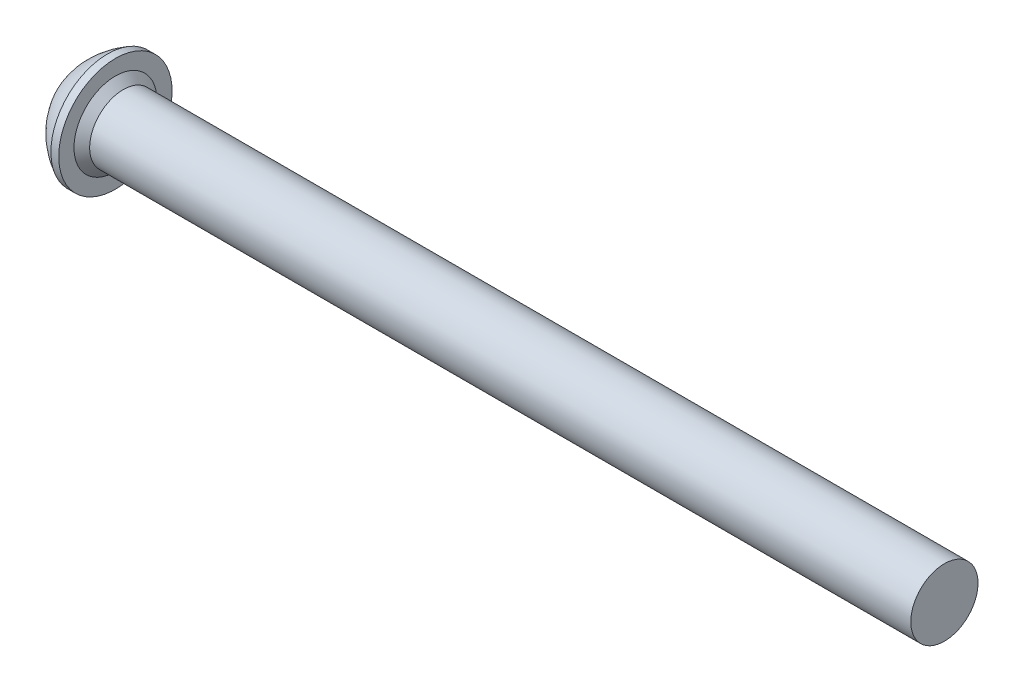
ISO-10303-21;
HEADER;
FILE_DESCRIPTION(('STEP AP214'),'2;1');
FILE_NAME('part.step','',(''),(''),'','','');
FILE_SCHEMA(('AUTOMOTIVE_DESIGN { 1 0 10303 214 1 1 1 1 }'));
ENDSEC;
DATA;
#1=APPLICATION_CONTEXT('core data for automotive mechanical design processes');
#2=APPLICATION_PROTOCOL_DEFINITION('international standard','automotive_design',2000,#1);
#3=PRODUCT_CONTEXT('',#1,'mechanical');
#4=PRODUCT('Part','Part','',(#3));
#5=PRODUCT_RELATED_PRODUCT_CATEGORY('part','',(#4));
#6=PRODUCT_DEFINITION_FORMATION('','',#4);
#7=PRODUCT_DEFINITION_CONTEXT('part definition',#1,'design');
#8=PRODUCT_DEFINITION('design','',#6,#7);
#9=PRODUCT_DEFINITION_SHAPE('','',#8);
#10=(LENGTH_UNIT() NAMED_UNIT(*) SI_UNIT(.MILLI.,.METRE.));
#11=(NAMED_UNIT(*) PLANE_ANGLE_UNIT() SI_UNIT($,.RADIAN.));
#12=(NAMED_UNIT(*) SI_UNIT($,.STERADIAN.) SOLID_ANGLE_UNIT());
#13=UNCERTAINTY_MEASURE_WITH_UNIT(LENGTH_MEASURE(1.E-05),#10,'distance_accuracy_value','');
#14=(GEOMETRIC_REPRESENTATION_CONTEXT(3) GLOBAL_UNCERTAINTY_ASSIGNED_CONTEXT((#13)) GLOBAL_UNIT_ASSIGNED_CONTEXT((#10,
#11,#12)) REPRESENTATION_CONTEXT('',''));
#15=CARTESIAN_POINT('',(0.,0.,0.));
#16=DIRECTION('',(0.,0.,1.));
#17=DIRECTION('',(1.,0.,0.));
#18=AXIS2_PLACEMENT_3D('',#15,#16,#17);
#19=CARTESIAN_POINT('',(38.6,1.5,0.));
#20=DIRECTION('',(1.,0.,0.));
#21=DIRECTION('',(0.,1.,0.));
#22=AXIS2_PLACEMENT_3D('',#19,#20,#21);
#23=PLANE('',#22);
#24=CARTESIAN_POINT('',(38.6,0.,0.));
#25=DIRECTION('',(1.,0.,0.));
#26=DIRECTION('',(0.,1.,0.));
#27=AXIS2_PLACEMENT_3D('',#24,#25,#26);
#28=CIRCLE('',#27,1.5);
#29=CARTESIAN_POINT('',(38.6,1.5,0.));
#30=VERTEX_POINT('',#29);
#31=EDGE_CURVE('E11',#30,#30,#28,.T.);
#32=ORIENTED_EDGE('',*,*,#31,.T.);
#33=EDGE_LOOP('',(#32));
#34=FACE_BOUND('',#33,.T.);
#35=ADVANCED_FACE('F33',(#34),#23,.T.);
#36=CARTESIAN_POINT('',(38.6,0.,0.));
#37=DIRECTION('',(1.,0.,0.));
#38=DIRECTION('',(0.,1.,0.));
#39=AXIS2_PLACEMENT_3D('',#36,#37,#38);
#40=CYLINDRICAL_SURFACE('',#39,1.5);
#41=CARTESIAN_POINT('',(1.95,0.,0.));
#42=DIRECTION('',(1.,0.,0.));
#43=DIRECTION('',(0.,1.,0.));
#44=AXIS2_PLACEMENT_3D('',#41,#42,#43);
#45=CIRCLE('',#44,1.5);
#46=CARTESIAN_POINT('',(1.95,1.5,0.));
#47=VERTEX_POINT('',#46);
#48=EDGE_CURVE('E40',#47,#47,#45,.T.);
#49=ORIENTED_EDGE('',*,*,#48,.T.);
#50=EDGE_LOOP('',(#49));
#51=FACE_BOUND('',#50,.T.);
#52=ORIENTED_EDGE('',*,*,#31,.F.);
#53=EDGE_LOOP('',(#52));
#54=FACE_BOUND('',#53,.T.);
#55=ADVANCED_FACE('F153',(#51,#54),#40,.T.);
#56=CARTESIAN_POINT('',(1.95,0.,0.));
#57=DIRECTION('',(-1.,0.,0.));
#58=DIRECTION('',(0.,-1.,0.));
#59=AXIS2_PLACEMENT_3D('',#56,#57,#58);
#60=CONICAL_SURFACE('',#59,1.5,0.785398163397446);
#61=CARTESIAN_POINT('',(1.6,0.,0.));
#62=DIRECTION('',(1.,0.,0.));
#63=DIRECTION('',(0.,1.,0.));
#64=AXIS2_PLACEMENT_3D('',#61,#62,#63);
#65=CIRCLE('',#64,1.85);
#66=CARTESIAN_POINT('',(1.6,1.85,0.));
#67=VERTEX_POINT('',#66);
#68=EDGE_CURVE('E148',#67,#67,#65,.T.);
#69=ORIENTED_EDGE('',*,*,#68,.T.);
#70=EDGE_LOOP('',(#69));
#71=FACE_BOUND('',#70,.T.);
#72=ORIENTED_EDGE('',*,*,#48,.F.);
#73=EDGE_LOOP('',(#72));
#74=FACE_BOUND('',#73,.T.);
#75=ADVANCED_FACE('F156',(#71,#74),#60,.T.);
#76=CARTESIAN_POINT('',(1.6,2.53,0.));
#77=DIRECTION('',(1.,0.,0.));
#78=DIRECTION('',(0.,1.,0.));
#79=AXIS2_PLACEMENT_3D('',#76,#77,#78);
#80=PLANE('',#79);
#81=CARTESIAN_POINT('',(1.6,0.,0.));
#82=DIRECTION('',(1.,0.,0.));
#83=DIRECTION('',(0.,1.,0.));
#84=AXIS2_PLACEMENT_3D('',#81,#82,#83);
#85=CIRCLE('',#84,2.53);
#86=CARTESIAN_POINT('',(1.6,2.53,0.));
#87=VERTEX_POINT('',#86);
#88=EDGE_CURVE('E145',#87,#87,#85,.T.);
#89=ORIENTED_EDGE('',*,*,#88,.T.);
#90=EDGE_LOOP('',(#89));
#91=FACE_BOUND('',#90,.T.);
#92=ORIENTED_EDGE('',*,*,#68,.F.);
#93=EDGE_LOOP('',(#92));
#94=FACE_BOUND('',#93,.T.);
#95=ADVANCED_FACE('F158',(#91,#94),#80,.T.);
#96=CARTESIAN_POINT('',(38.6,0.,0.));
#97=DIRECTION('',(1.,0.,0.));
#98=DIRECTION('',(0.,1.,0.));
#99=AXIS2_PLACEMENT_3D('',#96,#97,#98);
#100=CYLINDRICAL_SURFACE('',#99,2.53);
#101=CARTESIAN_POINT('',(1.25,0.,0.));
#102=DIRECTION('',(1.,0.,0.));
#103=DIRECTION('',(0.,1.,0.));
#104=AXIS2_PLACEMENT_3D('',#101,#102,#103);
#105=CIRCLE('',#104,2.53);
#106=CARTESIAN_POINT('',(1.25,2.53,0.));
#107=VERTEX_POINT('',#106);
#108=EDGE_CURVE('E142',#107,#107,#105,.T.);
#109=ORIENTED_EDGE('',*,*,#108,.T.);
#110=EDGE_LOOP('',(#109));
#111=FACE_BOUND('',#110,.T.);
#112=ORIENTED_EDGE('',*,*,#88,.F.);
#113=EDGE_LOOP('',(#112));
#114=FACE_BOUND('',#113,.T.);
#115=ADVANCED_FACE('F165',(#111,#114),#100,.T.);
#116=CARTESIAN_POINT('',(2.87083122473417,0.,0.));
#117=DIRECTION('',(1.,0.,0.));
#118=DIRECTION('',(0.,1.,0.));
#119=AXIS2_PLACEMENT_3D('',#116,#117,#118);
#120=DEGENERATE_TOROIDAL_SURFACE('',#119,0.572080937197923,3.5,.F.);
#121=CARTESIAN_POINT('',(0.,0.,0.));
#122=DIRECTION('',(1.,0.,0.));
#123=DIRECTION('',(0.,1.,0.));
#124=AXIS2_PLACEMENT_3D('',#121,#122,#123);
#125=CIRCLE('',#124,1.43);
#126=CARTESIAN_POINT('',(0.,1.43,0.));
#127=VERTEX_POINT('',#126);
#128=EDGE_CURVE('E134',#127,#127,#125,.T.);
#129=ORIENTED_EDGE('',*,*,#128,.T.);
#130=EDGE_LOOP('',(#129));
#131=FACE_BOUND('',#130,.T.);
#132=ORIENTED_EDGE('',*,*,#108,.F.);
#133=EDGE_LOOP('',(#132));
#134=FACE_BOUND('',#133,.T.);
#135=ADVANCED_FACE('F196',(#131,#134),#120,.F.);
#136=CARTESIAN_POINT('',(0.,0.,0.));
#137=DIRECTION('',(-1.,0.,0.));
#138=DIRECTION('',(0.,-1.,0.));
#139=AXIS2_PLACEMENT_3D('',#136,#137,#138);
#140=PLANE('',#139);
#141=DIRECTION('',(0.,0.5,-0.866025403784439));
#142=VECTOR('',#141,1.);
#143=CARTESIAN_POINT('',(0.,0.577350269189626,1.));
#144=LINE('',#143,#142);
#145=CARTESIAN_POINT('',(0.,0.577350269189626,1.));
#146=VERTEX_POINT('',#145);
#147=CARTESIAN_POINT('',(0.,1.15470053837925,0.));
#148=VERTEX_POINT('',#147);
#149=EDGE_CURVE('E47',#146,#148,#144,.T.);
#150=ORIENTED_EDGE('',*,*,#149,.F.);
#151=DIRECTION('',(0.,1.,0.));
#152=VECTOR('',#151,1.);
#153=CARTESIAN_POINT('',(0.,-0.577350269189626,1.));
#154=LINE('',#153,#152);
#155=CARTESIAN_POINT('',(0.,-0.577350269189626,1.));
#156=VERTEX_POINT('',#155);
#157=EDGE_CURVE('E130',#156,#146,#154,.T.);
#158=ORIENTED_EDGE('',*,*,#157,.F.);
#159=DIRECTION('',(0.,0.5,0.866025403784439));
#160=VECTOR('',#159,1.);
#161=CARTESIAN_POINT('',(0.,-1.15470053837925,0.));
#162=LINE('',#161,#160);
#163=CARTESIAN_POINT('',(0.,-1.15470053837925,0.));
#164=VERTEX_POINT('',#163);
#165=EDGE_CURVE('E128',#164,#156,#162,.T.);
#166=ORIENTED_EDGE('',*,*,#165,.F.);
#167=DIRECTION('',(0.,-0.5,0.866025403784439));
#168=VECTOR('',#167,1.);
#169=CARTESIAN_POINT('',(0.,-0.577350269189626,-1.));
#170=LINE('',#169,#168);
#171=CARTESIAN_POINT('',(0.,-0.577350269189626,-1.));
#172=VERTEX_POINT('',#171);
#173=EDGE_CURVE('E95',#172,#164,#170,.T.);
#174=ORIENTED_EDGE('',*,*,#173,.F.);
#175=DIRECTION('',(0.,-1.,0.));
#176=VECTOR('',#175,1.);
#177=CARTESIAN_POINT('',(0.,0.577350269189626,-1.));
#178=LINE('',#177,#176);
#179=CARTESIAN_POINT('',(0.,0.577350269189626,-1.));
#180=VERTEX_POINT('',#179);
#181=EDGE_CURVE('E124',#180,#172,#178,.T.);
#182=ORIENTED_EDGE('',*,*,#181,.F.);
#183=DIRECTION('',(0.,-0.5,-0.866025403784439));
#184=VECTOR('',#183,1.);
#185=CARTESIAN_POINT('',(0.,1.15470053837925,0.));
#186=LINE('',#185,#184);
#187=EDGE_CURVE('E121',#148,#180,#186,.T.);
#188=ORIENTED_EDGE('',*,*,#187,.F.);
#189=EDGE_LOOP('',(#150,#158,#166,#174,#182,#188));
#190=FACE_BOUND('',#189,.T.);
#191=ORIENTED_EDGE('',*,*,#128,.F.);
#192=EDGE_LOOP('',(#191));
#193=FACE_BOUND('',#192,.T.);
#194=ADVANCED_FACE('F206',(#190,#193),#140,.T.);
#195=CARTESIAN_POINT('',(1.,0.577350269189626,1.));
#196=DIRECTION('',(0.,0.866025403784439,0.5));
#197=DIRECTION('',(0.,-0.5,0.866025403784439));
#198=AXIS2_PLACEMENT_3D('',#195,#196,#197);
#199=PLANE('',#198);
#200=ORIENTED_EDGE('',*,*,#149,.T.);
#201=DIRECTION('',(-1.,0.,0.));
#202=VECTOR('',#201,1.);
#203=CARTESIAN_POINT('',(1.,1.15470053837925,0.));
#204=LINE('',#203,#202);
#205=CARTESIAN_POINT('',(1.,1.15470053837925,0.));
#206=VERTEX_POINT('',#205);
#207=EDGE_CURVE('E77',#206,#148,#204,.T.);
#208=ORIENTED_EDGE('',*,*,#207,.F.);
#209=DIRECTION('',(0.,0.5,-0.866025403784439));
#210=VECTOR('',#209,1.);
#211=CARTESIAN_POINT('',(1.,0.577350269189626,1.));
#212=LINE('',#211,#210);
#213=CARTESIAN_POINT('',(1.,0.577350269189626,1.));
#214=VERTEX_POINT('',#213);
#215=EDGE_CURVE('E132',#214,#206,#212,.T.);
#216=ORIENTED_EDGE('',*,*,#215,.F.);
#217=DIRECTION('',(-1.,0.,0.));
#218=VECTOR('',#217,1.);
#219=CARTESIAN_POINT('',(1.,0.577350269189626,1.));
#220=LINE('',#219,#218);
#221=EDGE_CURVE('E55',#214,#146,#220,.T.);
#222=ORIENTED_EDGE('',*,*,#221,.T.);
#223=EDGE_LOOP('',(#200,#208,#216,#222));
#224=FACE_BOUND('',#223,.T.);
#225=ADVANCED_FACE('F216',(#224),#199,.F.);
#226=CARTESIAN_POINT('',(1.,-0.577350269189626,1.));
#227=DIRECTION('',(0.,0.,1.));
#228=DIRECTION('',(0.,-1.,0.));
#229=AXIS2_PLACEMENT_3D('',#226,#227,#228);
#230=PLANE('',#229);
#231=ORIENTED_EDGE('',*,*,#157,.T.);
#232=ORIENTED_EDGE('',*,*,#221,.F.);
#233=DIRECTION('',(0.,1.,0.));
#234=VECTOR('',#233,1.);
#235=CARTESIAN_POINT('',(1.,-0.577350269189626,1.));
#236=LINE('',#235,#234);
#237=CARTESIAN_POINT('',(1.,-0.577350269189626,1.));
#238=VERTEX_POINT('',#237);
#239=EDGE_CURVE('E107',#238,#214,#236,.T.);
#240=ORIENTED_EDGE('',*,*,#239,.F.);
#241=DIRECTION('',(-1.,0.,0.));
#242=VECTOR('',#241,1.);
#243=CARTESIAN_POINT('',(1.,-0.577350269189626,1.));
#244=LINE('',#243,#242);
#245=EDGE_CURVE('E99',#238,#156,#244,.T.);
#246=ORIENTED_EDGE('',*,*,#245,.T.);
#247=EDGE_LOOP('',(#231,#232,#240,#246));
#248=FACE_BOUND('',#247,.T.);
#249=ADVANCED_FACE('F226',(#248),#230,.F.);
#250=CARTESIAN_POINT('',(1.,-1.15470053837925,0.));
#251=DIRECTION('',(0.,-0.866025403784439,0.5));
#252=DIRECTION('',(0.,-0.5,-0.866025403784439));
#253=AXIS2_PLACEMENT_3D('',#250,#251,#252);
#254=PLANE('',#253);
#255=ORIENTED_EDGE('',*,*,#165,.T.);
#256=ORIENTED_EDGE('',*,*,#245,.F.);
#257=DIRECTION('',(0.,0.5,0.866025403784439));
#258=VECTOR('',#257,1.);
#259=CARTESIAN_POINT('',(1.,-1.15470053837925,0.));
#260=LINE('',#259,#258);
#261=CARTESIAN_POINT('',(1.,-1.15470053837925,0.));
#262=VERTEX_POINT('',#261);
#263=EDGE_CURVE('E103',#262,#238,#260,.T.);
#264=ORIENTED_EDGE('',*,*,#263,.F.);
#265=DIRECTION('',(-1.,0.,0.));
#266=VECTOR('',#265,1.);
#267=CARTESIAN_POINT('',(1.,-1.15470053837925,0.));
#268=LINE('',#267,#266);
#269=EDGE_CURVE('E88',#262,#164,#268,.T.);
#270=ORIENTED_EDGE('',*,*,#269,.T.);
#271=EDGE_LOOP('',(#255,#256,#264,#270));
#272=FACE_BOUND('',#271,.T.);
#273=ADVANCED_FACE('F104',(#272),#254,.F.);
#274=CARTESIAN_POINT('',(1.,-0.577350269189626,-1.));
#275=DIRECTION('',(0.,-0.866025403784439,-0.5));
#276=DIRECTION('',(0.,0.5,-0.866025403784439));
#277=AXIS2_PLACEMENT_3D('',#274,#275,#276);
#278=PLANE('',#277);
#279=ORIENTED_EDGE('',*,*,#173,.T.);
#280=ORIENTED_EDGE('',*,*,#269,.F.);
#281=DIRECTION('',(0.,-0.5,0.866025403784439));
#282=VECTOR('',#281,1.);
#283=CARTESIAN_POINT('',(1.,-0.577350269189626,-1.));
#284=LINE('',#283,#282);
#285=CARTESIAN_POINT('',(1.,-0.577350269189626,-1.));
#286=VERTEX_POINT('',#285);
#287=EDGE_CURVE('E92',#286,#262,#284,.T.);
#288=ORIENTED_EDGE('',*,*,#287,.F.);
#289=DIRECTION('',(-1.,0.,0.));
#290=VECTOR('',#289,1.);
#291=CARTESIAN_POINT('',(1.,-0.577350269189626,-1.));
#292=LINE('',#291,#290);
#293=EDGE_CURVE('E100',#286,#172,#292,.T.);
#294=ORIENTED_EDGE('',*,*,#293,.T.);
#295=EDGE_LOOP('',(#279,#280,#288,#294));
#296=FACE_BOUND('',#295,.T.);
#297=ADVANCED_FACE('F90',(#296),#278,.F.);
#298=CARTESIAN_POINT('',(1.,0.577350269189626,-1.));
#299=DIRECTION('',(0.,0.,-1.));
#300=DIRECTION('',(-1.,0.,0.));
#301=AXIS2_PLACEMENT_3D('',#298,#299,#300);
#302=PLANE('',#301);
#303=ORIENTED_EDGE('',*,*,#181,.T.);
#304=ORIENTED_EDGE('',*,*,#293,.F.);
#305=DIRECTION('',(0.,-1.,0.));
#306=VECTOR('',#305,1.);
#307=CARTESIAN_POINT('',(1.,0.577350269189626,-1.));
#308=LINE('',#307,#306);
#309=CARTESIAN_POINT('',(1.,0.577350269189626,-1.));
#310=VERTEX_POINT('',#309);
#311=EDGE_CURVE('E113',#310,#286,#308,.T.);
#312=ORIENTED_EDGE('',*,*,#311,.F.);
#313=DIRECTION('',(-1.,0.,0.));
#314=VECTOR('',#313,1.);
#315=CARTESIAN_POINT('',(1.,0.577350269189626,-1.));
#316=LINE('',#315,#314);
#317=EDGE_CURVE('E137',#310,#180,#316,.T.);
#318=ORIENTED_EDGE('',*,*,#317,.T.);
#319=EDGE_LOOP('',(#303,#304,#312,#318));
#320=FACE_BOUND('',#319,.T.);
#321=ADVANCED_FACE('F251',(#320),#302,.F.);
#322=CARTESIAN_POINT('',(1.,1.15470053837925,0.));
#323=DIRECTION('',(0.,0.866025403784439,-0.5));
#324=DIRECTION('',(0.,0.5,0.866025403784439));
#325=AXIS2_PLACEMENT_3D('',#322,#323,#324);
#326=PLANE('',#325);
#327=ORIENTED_EDGE('',*,*,#187,.T.);
#328=ORIENTED_EDGE('',*,*,#317,.F.);
#329=DIRECTION('',(0.,-0.5,-0.866025403784439));
#330=VECTOR('',#329,1.);
#331=CARTESIAN_POINT('',(1.,1.15470053837925,0.));
#332=LINE('',#331,#330);
#333=EDGE_CURVE('E115',#206,#310,#332,.T.);
#334=ORIENTED_EDGE('',*,*,#333,.F.);
#335=ORIENTED_EDGE('',*,*,#207,.T.);
#336=EDGE_LOOP('',(#327,#328,#334,#335));
#337=FACE_BOUND('',#336,.T.);
#338=ADVANCED_FACE('F260',(#337),#326,.F.);
#339=CARTESIAN_POINT('',(1.,0.,0.));
#340=DIRECTION('',(-1.,0.,0.));
#341=DIRECTION('',(0.,-1.,0.));
#342=AXIS2_PLACEMENT_3D('',#339,#340,#341);
#343=PLANE('',#342);
#344=ORIENTED_EDGE('',*,*,#215,.T.);
#345=ORIENTED_EDGE('',*,*,#333,.T.);
#346=ORIENTED_EDGE('',*,*,#311,.T.);
#347=ORIENTED_EDGE('',*,*,#287,.T.);
#348=ORIENTED_EDGE('',*,*,#263,.T.);
#349=ORIENTED_EDGE('',*,*,#239,.T.);
#350=EDGE_LOOP('',(#344,#345,#346,#347,#348,#349));
#351=FACE_BOUND('',#350,.T.);
#352=ADVANCED_FACE('F110',(#351),#343,.T.);
#353=CLOSED_SHELL('',(#35,#55,#75,#95,#115,#135,#194,#225,#249,#273,#297,#321,#338,#352));
#354=MANIFOLD_SOLID_BREP('B2',#353);
#355=ADVANCED_BREP_SHAPE_REPRESENTATION('',(#18,#354),#14);
#356=SHAPE_DEFINITION_REPRESENTATION(#9,#355);
ENDSEC;
END-ISO-10303-21;
